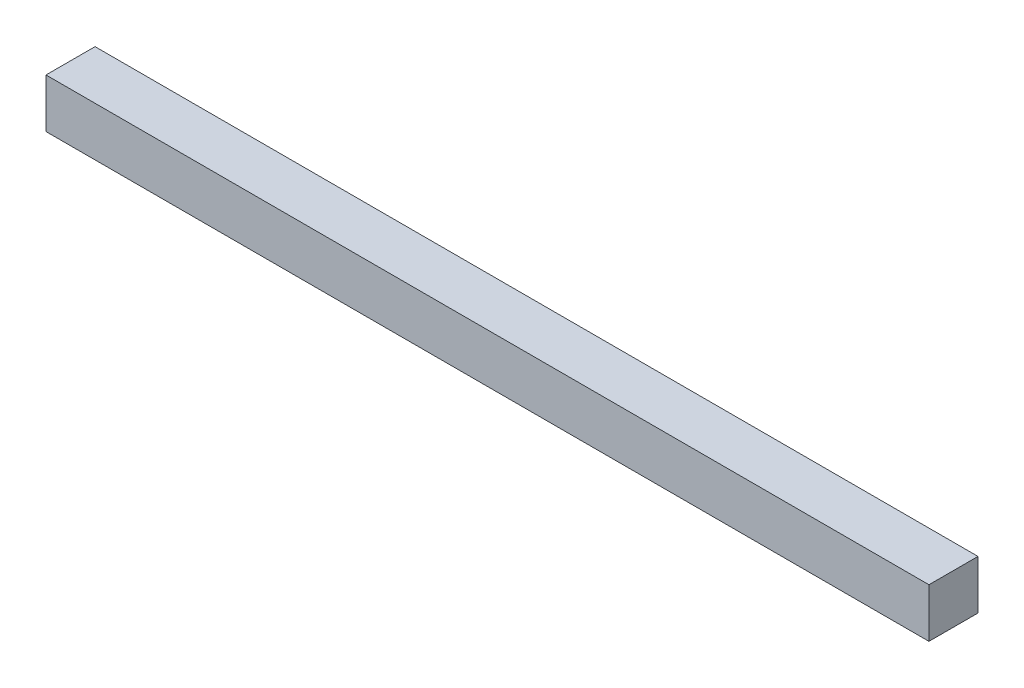
ISO-10303-21;
HEADER;
FILE_DESCRIPTION(('STEP AP214'),'2;1');
FILE_NAME('part.step','',(''),(''),'','','');
FILE_SCHEMA(('AUTOMOTIVE_DESIGN { 1 0 10303 214 1 1 1 1 }'));
ENDSEC;
DATA;
#1=APPLICATION_CONTEXT('core data for automotive mechanical design processes');
#2=APPLICATION_PROTOCOL_DEFINITION('international standard','automotive_design',2000,#1);
#3=PRODUCT_CONTEXT('',#1,'mechanical');
#4=PRODUCT('Part','Part','',(#3));
#5=PRODUCT_RELATED_PRODUCT_CATEGORY('part','',(#4));
#6=PRODUCT_DEFINITION_FORMATION('','',#4);
#7=PRODUCT_DEFINITION_CONTEXT('part definition',#1,'design');
#8=PRODUCT_DEFINITION('design','',#6,#7);
#9=PRODUCT_DEFINITION_SHAPE('','',#8);
#10=(LENGTH_UNIT() NAMED_UNIT(*) SI_UNIT(.MILLI.,.METRE.));
#11=(NAMED_UNIT(*) PLANE_ANGLE_UNIT() SI_UNIT($,.RADIAN.));
#12=(NAMED_UNIT(*) SI_UNIT($,.STERADIAN.) SOLID_ANGLE_UNIT());
#13=UNCERTAINTY_MEASURE_WITH_UNIT(LENGTH_MEASURE(1.E-05),#10,'distance_accuracy_value','');
#14=(GEOMETRIC_REPRESENTATION_CONTEXT(3) GLOBAL_UNCERTAINTY_ASSIGNED_CONTEXT((#13)) GLOBAL_UNIT_ASSIGNED_CONTEXT((#10,
#11,#12)) REPRESENTATION_CONTEXT('',''));
#15=CARTESIAN_POINT('',(0.,0.,0.));
#16=DIRECTION('',(0.,0.,1.));
#17=DIRECTION('',(1.,0.,0.));
#18=AXIS2_PLACEMENT_3D('',#15,#16,#17);
#19=CARTESIAN_POINT('',(57.15,-3.175,3.175));
#20=DIRECTION('',(0.,0.,-1.));
#21=DIRECTION('',(-1.,0.,0.));
#22=AXIS2_PLACEMENT_3D('',#19,#20,#21);
#23=PLANE('',#22);
#24=DIRECTION('',(0.,-1.,0.));
#25=VECTOR('',#24,1.);
#26=CARTESIAN_POINT('',(-57.15,-3.175,3.175));
#27=LINE('',#26,#25);
#28=CARTESIAN_POINT('',(-57.15,3.175,3.175));
#29=VERTEX_POINT('',#28);
#30=CARTESIAN_POINT('',(-57.15,-3.175,3.175));
#31=VERTEX_POINT('',#30);
#32=EDGE_CURVE('E98',#29,#31,#27,.T.);
#33=ORIENTED_EDGE('',*,*,#32,.T.);
#34=DIRECTION('',(-1.,0.,0.));
#35=VECTOR('',#34,1.);
#36=CARTESIAN_POINT('',(57.15,-3.175,3.175));
#37=LINE('',#36,#35);
#38=CARTESIAN_POINT('',(57.15,-3.175,3.175));
#39=VERTEX_POINT('',#38);
#40=EDGE_CURVE('E11',#39,#31,#37,.T.);
#41=ORIENTED_EDGE('',*,*,#40,.F.);
#42=DIRECTION('',(0.,-1.,0.));
#43=VECTOR('',#42,1.);
#44=CARTESIAN_POINT('',(57.15,-3.175,3.175));
#45=LINE('',#44,#43);
#46=CARTESIAN_POINT('',(57.15,3.175,3.175));
#47=VERTEX_POINT('',#46);
#48=EDGE_CURVE('E86',#47,#39,#45,.T.);
#49=ORIENTED_EDGE('',*,*,#48,.F.);
#50=DIRECTION('',(-1.,0.,0.));
#51=VECTOR('',#50,1.);
#52=CARTESIAN_POINT('',(57.15,3.175,3.175));
#53=LINE('',#52,#51);
#54=EDGE_CURVE('E94',#47,#29,#53,.T.);
#55=ORIENTED_EDGE('',*,*,#54,.T.);
#56=EDGE_LOOP('',(#33,#41,#49,#55));
#57=FACE_BOUND('',#56,.T.);
#58=ADVANCED_FACE('F35',(#57),#23,.F.);
#59=CARTESIAN_POINT('',(57.15,-3.175,-3.175));
#60=DIRECTION('',(0.,1.,0.));
#61=DIRECTION('',(0.,0.,1.));
#62=AXIS2_PLACEMENT_3D('',#59,#60,#61);
#63=PLANE('',#62);
#64=DIRECTION('',(0.,0.,-1.));
#65=VECTOR('',#64,1.);
#66=CARTESIAN_POINT('',(-57.15,-3.175,-3.175));
#67=LINE('',#66,#65);
#68=CARTESIAN_POINT('',(-57.15,-3.175,-3.175));
#69=VERTEX_POINT('',#68);
#70=EDGE_CURVE('E90',#31,#69,#67,.T.);
#71=ORIENTED_EDGE('',*,*,#70,.T.);
#72=DIRECTION('',(-1.,0.,0.));
#73=VECTOR('',#72,1.);
#74=CARTESIAN_POINT('',(57.15,-3.175,-3.175));
#75=LINE('',#74,#73);
#76=CARTESIAN_POINT('',(57.15,-3.175,-3.175));
#77=VERTEX_POINT('',#76);
#78=EDGE_CURVE('E43',#77,#69,#75,.T.);
#79=ORIENTED_EDGE('',*,*,#78,.F.);
#80=DIRECTION('',(0.,0.,-1.));
#81=VECTOR('',#80,1.);
#82=CARTESIAN_POINT('',(57.15,-3.175,-3.175));
#83=LINE('',#82,#81);
#84=EDGE_CURVE('E81',#39,#77,#83,.T.);
#85=ORIENTED_EDGE('',*,*,#84,.F.);
#86=ORIENTED_EDGE('',*,*,#40,.T.);
#87=EDGE_LOOP('',(#71,#79,#85,#86));
#88=FACE_BOUND('',#87,.T.);
#89=ADVANCED_FACE('F89',(#88),#63,.F.);
#90=CARTESIAN_POINT('',(57.15,-3.175,-3.175));
#91=DIRECTION('',(0.,0.,1.));
#92=DIRECTION('',(1.,0.,0.));
#93=AXIS2_PLACEMENT_3D('',#90,#91,#92);
#94=PLANE('',#93);
#95=DIRECTION('',(0.,1.,0.));
#96=VECTOR('',#95,1.);
#97=CARTESIAN_POINT('',(-57.15,-3.175,-3.175));
#98=LINE('',#97,#96);
#99=CARTESIAN_POINT('',(-57.15,3.175,-3.175));
#100=VERTEX_POINT('',#99);
#101=EDGE_CURVE('E68',#69,#100,#98,.T.);
#102=ORIENTED_EDGE('',*,*,#101,.T.);
#103=DIRECTION('',(-1.,0.,0.));
#104=VECTOR('',#103,1.);
#105=CARTESIAN_POINT('',(57.15,3.175,-3.175));
#106=LINE('',#105,#104);
#107=CARTESIAN_POINT('',(57.15,3.175,-3.175));
#108=VERTEX_POINT('',#107);
#109=EDGE_CURVE('E91',#108,#100,#106,.T.);
#110=ORIENTED_EDGE('',*,*,#109,.F.);
#111=DIRECTION('',(0.,1.,0.));
#112=VECTOR('',#111,1.);
#113=CARTESIAN_POINT('',(57.15,-3.175,-3.175));
#114=LINE('',#113,#112);
#115=EDGE_CURVE('E84',#77,#108,#114,.T.);
#116=ORIENTED_EDGE('',*,*,#115,.F.);
#117=ORIENTED_EDGE('',*,*,#78,.T.);
#118=EDGE_LOOP('',(#102,#110,#116,#117));
#119=FACE_BOUND('',#118,.T.);
#120=ADVANCED_FACE('F92',(#119),#94,.F.);
#121=CARTESIAN_POINT('',(57.15,3.175,-3.175));
#122=DIRECTION('',(0.,-1.,0.));
#123=DIRECTION('',(0.,0.,-1.));
#124=AXIS2_PLACEMENT_3D('',#121,#122,#123);
#125=PLANE('',#124);
#126=DIRECTION('',(0.,0.,1.));
#127=VECTOR('',#126,1.);
#128=CARTESIAN_POINT('',(-57.15,3.175,-3.175));
#129=LINE('',#128,#127);
#130=EDGE_CURVE('E74',#100,#29,#129,.T.);
#131=ORIENTED_EDGE('',*,*,#130,.T.);
#132=ORIENTED_EDGE('',*,*,#54,.F.);
#133=DIRECTION('',(0.,0.,1.));
#134=VECTOR('',#133,1.);
#135=CARTESIAN_POINT('',(57.15,3.175,-3.175));
#136=LINE('',#135,#134);
#137=EDGE_CURVE('E51',#108,#47,#136,.T.);
#138=ORIENTED_EDGE('',*,*,#137,.F.);
#139=ORIENTED_EDGE('',*,*,#109,.T.);
#140=EDGE_LOOP('',(#131,#132,#138,#139));
#141=FACE_BOUND('',#140,.T.);
#142=ADVANCED_FACE('F105',(#141),#125,.F.);
#143=CARTESIAN_POINT('',(57.15,0.,0.));
#144=DIRECTION('',(1.,0.,0.));
#145=DIRECTION('',(0.,0.,-1.));
#146=AXIS2_PLACEMENT_3D('',#143,#144,#145);
#147=PLANE('',#146);
#148=ORIENTED_EDGE('',*,*,#48,.T.);
#149=ORIENTED_EDGE('',*,*,#84,.T.);
#150=ORIENTED_EDGE('',*,*,#115,.T.);
#151=ORIENTED_EDGE('',*,*,#137,.T.);
#152=EDGE_LOOP('',(#148,#149,#150,#151));
#153=FACE_BOUND('',#152,.T.);
#154=ADVANCED_FACE('F82',(#153),#147,.T.);
#155=CARTESIAN_POINT('',(-57.15,0.,0.));
#156=DIRECTION('',(1.,0.,0.));
#157=DIRECTION('',(0.,0.,-1.));
#158=AXIS2_PLACEMENT_3D('',#155,#156,#157);
#159=PLANE('',#158);
#160=ORIENTED_EDGE('',*,*,#32,.F.);
#161=ORIENTED_EDGE('',*,*,#130,.F.);
#162=ORIENTED_EDGE('',*,*,#101,.F.);
#163=ORIENTED_EDGE('',*,*,#70,.F.);
#164=EDGE_LOOP('',(#160,#161,#162,#163));
#165=FACE_BOUND('',#164,.T.);
#166=ADVANCED_FACE('F108',(#165),#159,.F.);
#167=CLOSED_SHELL('',(#58,#89,#120,#142,#154,#166));
#168=MANIFOLD_SOLID_BREP('B2',#167);
#169=ADVANCED_BREP_SHAPE_REPRESENTATION('',(#18,#168),#14);
#170=SHAPE_DEFINITION_REPRESENTATION(#9,#169);
ENDSEC;
END-ISO-10303-21;
